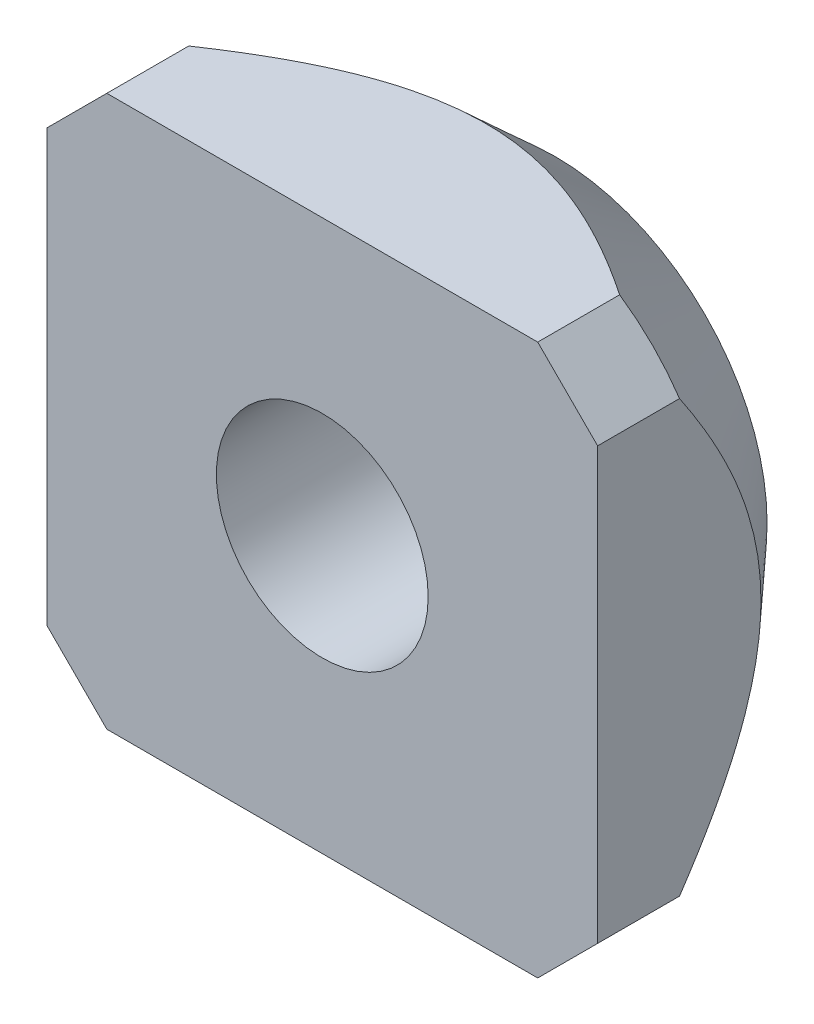
ISO-10303-21;
HEADER;
FILE_DESCRIPTION(('STEP AP214'),'2;1');
FILE_NAME('part.step','',(''),(''),'','','');
FILE_SCHEMA(('AUTOMOTIVE_DESIGN { 1 0 10303 214 1 1 1 1 }'));
ENDSEC;
DATA;
#1=APPLICATION_CONTEXT('core data for automotive mechanical design processes');
#2=APPLICATION_PROTOCOL_DEFINITION('international standard','automotive_design',2000,#1);
#3=PRODUCT_CONTEXT('',#1,'mechanical');
#4=PRODUCT('Part','Part','',(#3));
#5=PRODUCT_RELATED_PRODUCT_CATEGORY('part','',(#4));
#6=PRODUCT_DEFINITION_FORMATION('','',#4);
#7=PRODUCT_DEFINITION_CONTEXT('part definition',#1,'design');
#8=PRODUCT_DEFINITION('design','',#6,#7);
#9=PRODUCT_DEFINITION_SHAPE('','',#8);
#10=(LENGTH_UNIT() NAMED_UNIT(*) SI_UNIT(.MILLI.,.METRE.));
#11=(NAMED_UNIT(*) PLANE_ANGLE_UNIT() SI_UNIT($,.RADIAN.));
#12=(NAMED_UNIT(*) SI_UNIT($,.STERADIAN.) SOLID_ANGLE_UNIT());
#13=UNCERTAINTY_MEASURE_WITH_UNIT(LENGTH_MEASURE(1.E-05),#10,'distance_accuracy_value','');
#14=(GEOMETRIC_REPRESENTATION_CONTEXT(3) GLOBAL_UNCERTAINTY_ASSIGNED_CONTEXT((#13)) GLOBAL_UNIT_ASSIGNED_CONTEXT((#10,
#11,#12)) REPRESENTATION_CONTEXT('',''));
#15=CARTESIAN_POINT('',(0.,0.,0.));
#16=DIRECTION('',(0.,0.,1.));
#17=DIRECTION('',(1.,0.,0.));
#18=AXIS2_PLACEMENT_3D('',#15,#16,#17);
#19=CARTESIAN_POINT('',(0.,0.,-5.5));
#20=DIRECTION('',(0.,0.,1.));
#21=DIRECTION('',(1.,0.,0.));
#22=AXIS2_PLACEMENT_3D('',#19,#20,#21);
#23=PLANE('',#22);
#24=CARTESIAN_POINT('',(0.,0.,-5.5));
#25=DIRECTION('',(0.,0.,1.));
#26=DIRECTION('',(1.,0.,0.));
#27=AXIS2_PLACEMENT_3D('',#24,#25,#26);
#28=CIRCLE('',#27,2.5);
#29=CARTESIAN_POINT('',(2.5,0.,-5.5));
#30=VERTEX_POINT('',#29);
#31=EDGE_CURVE('E258',#30,#30,#28,.T.);
#32=ORIENTED_EDGE('',*,*,#31,.T.);
#33=EDGE_LOOP('',(#32));
#34=FACE_BOUND('',#33,.T.);
#35=CARTESIAN_POINT('',(0.,0.,-5.50000000287154));
#36=DIRECTION('',(0.,0.,1.));
#37=DIRECTION('',(1.,0.,0.));
#38=AXIS2_PLACEMENT_3D('',#35,#36,#37);
#39=CIRCLE('',#38,5.00000000314824);
#40=CARTESIAN_POINT('',(5.00000000314824,0.,-5.50000000287154));
#41=VERTEX_POINT('',#40);
#42=EDGE_CURVE('E37',#41,#41,#39,.T.);
#43=ORIENTED_EDGE('',*,*,#42,.F.);
#44=EDGE_LOOP('',(#43));
#45=FACE_BOUND('',#44,.T.);
#46=ADVANCED_FACE('F34',(#34,#45),#23,.F.);
#47=CARTESIAN_POINT('',(0.,0.,-1.91193420733516));
#48=DIRECTION('',(0.,0.,1.));
#49=DIRECTION('',(1.,0.,0.));
#50=AXIS2_PLACEMENT_3D('',#47,#48,#49);
#51=CONICAL_SURFACE('',#50,8.27271392518171,0.739466056088912);
#52=ORIENTED_EDGE('',*,*,#42,.T.);
#53=EDGE_LOOP('',(#52));
#54=FACE_BOUND('',#53,.T.);
#55=CARTESIAN_POINT('',(-6.49999999996656,5.08578643774263,-1.93333420218814));
#56=CARTESIAN_POINT('',(-6.49999999998799,4.97217656549041,-2.01007902749409));
#57=CARTESIAN_POINT('',(-6.49999999999678,4.85782950972393,-2.08574579284289));
#58=CARTESIAN_POINT('',(-6.50000000000322,4.62749756275461,-2.23459577320099));
#59=CARTESIAN_POINT('',(-6.50000000000086,4.51151233122406,-2.30777846107305));
#60=CARTESIAN_POINT('',(-6.49999999999913,4.27735001893202,-2.45156937006614));
#61=CARTESIAN_POINT('',(-6.49999999999976,4.15916634847437,-2.52216690472437));
#62=CARTESIAN_POINT('',(-6.50000000000024,3.92090179825337,-2.66006146574261));
#63=CARTESIAN_POINT('',(-6.50000000000008,3.80082102170299,-2.72735867084667));
#64=CARTESIAN_POINT('',(-6.49999999999983,3.43117049901182,-2.927024197621));
#65=CARTESIAN_POINT('',(-6.49999999999995,3.17828163281151,-3.05336340735418));
#66=CARTESIAN_POINT('',(-6.50000000000004,2.66320472724055,-3.2847897494762));
#67=CARTESIAN_POINT('',(-6.50000000000001,2.40103115726329,-3.38990837532806));
#68=CARTESIAN_POINT('',(-6.49999999999999,1.96194937878003,-3.54007016332442));
#69=CARTESIAN_POINT('',(-6.5,1.78780916432668,-3.5931930058844));
#70=CARTESIAN_POINT('',(-6.5,1.43593803357401,-3.68604206605222));
#71=CARTESIAN_POINT('',(-6.5,1.25820705951024,-3.72576806796325));
#72=CARTESIAN_POINT('',(-6.5,0.901971243864608,-3.78972854936986));
#73=CARTESIAN_POINT('',(-6.5,0.723496609813822,-3.81412921930872));
#74=CARTESIAN_POINT('',(-6.5,0.365074863040264,-3.84691624104865));
#75=CARTESIAN_POINT('',(-6.5,0.185127876429945,-3.85530395029257));
#76=CARTESIAN_POINT('',(-6.5,-0.175331996863656,-3.85561829853934));
#77=CARTESIAN_POINT('',(-6.5,-0.355844930170432,-3.84749448568778));
#78=CARTESIAN_POINT('',(-6.5,-0.715412000901114,-3.81512247996494));
#79=CARTESIAN_POINT('',(-6.5,-0.894466007670494,-3.79087285866508));
#80=CARTESIAN_POINT('',(-6.5,-1.25186987190293,-3.72710369302864));
#81=CARTESIAN_POINT('',(-6.5,-1.43018938883302,-3.6874161876482));
#82=CARTESIAN_POINT('',(-6.5,-1.7832209983363,-3.59454247061222));
#83=CARTESIAN_POINT('',(-6.5,-1.95793314761956,-3.54135647133646));
#84=CARTESIAN_POINT('',(-6.5,-2.39791270686289,-3.39110767153733));
#85=CARTESIAN_POINT('',(-6.5,-2.66041462883235,-3.2859613732665));
#86=CARTESIAN_POINT('',(-6.5,-3.17612601907367,-3.05441341529704));
#87=CARTESIAN_POINT('',(-6.5,-3.4293209389517,-2.92798006949308));
#88=CARTESIAN_POINT('',(-6.5,-3.79940591229883,-2.72814379751195));
#89=CARTESIAN_POINT('',(-6.5,-3.91962359960432,-2.66078705978884));
#90=CARTESIAN_POINT('',(-6.5,-4.15815744619399,-2.52276484072712));
#91=CARTESIAN_POINT('',(-6.5,-4.27647350172637,-2.45209917967338));
#92=CARTESIAN_POINT('',(-6.5,-4.510894297226,-2.30816632365151));
#93=CARTESIAN_POINT('',(-6.5,-4.62700566745187,-2.23490988206234));
#94=CARTESIAN_POINT('',(-6.5,-4.85758619181249,-2.08590677964123));
#95=CARTESIAN_POINT('',(-6.5,-4.97205568825616,-2.01016064904319));
#96=CARTESIAN_POINT('',(-6.5,-5.08578643774838,-1.93333420220499));
#97=B_SPLINE_CURVE_WITH_KNOTS('',3,(#55,#56,#57,#58,#59,#60,#61,#62,#63,#64,#65,#66,#67,#68,#69,
#70,#71,#72,#73,#74,#75,#76,#77,#78,#79,#80,#81,#82,#83,#84,#85,#86,#87,#88,#89,#90,#91,#92,#93,
#94,#95,#96),.UNSPECIFIED.,.F.,.F.,(4,2,2,2,2,2,2,2,2,2,2,2,2,2,2,2,2,2,2,2,4),(0.,
0.41131042679013,0.822707597462602,1.23564791332838,1.64856583981778,2.49590493844257,
3.34197710361053,3.88772071571207,4.43347311417834,4.97320018567055,5.51288150165221,
6.05421432221896,6.59559510058552,7.1430386002873,7.69047348727104,8.53748456918338,
9.38576777125056,9.79913116863559,10.2125170428237,10.6243522063669,11.0361002217524),.UNSPECIFIED.);
#98=CARTESIAN_POINT('',(-6.50000000001247,5.08578643767711,-1.93333420224238));
#99=VERTEX_POINT('',#98);
#100=CARTESIAN_POINT('',(-6.50000000001247,-5.08578643767711,-1.93333420224238));
#101=VERTEX_POINT('',#100);
#102=EDGE_CURVE('E168',#99,#101,#97,.T.);
#103=ORIENTED_EDGE('',*,*,#102,.F.);
#104=CARTESIAN_POINT('',(-5.08578643758324,6.50000000000418,-1.93333420227152));
#105=CARTESIAN_POINT('',(-5.20320338743552,6.38258305017716,-1.95544496406807));
#106=CARTESIAN_POINT('',(-5.32114245529566,6.26464398232743,-1.97213629505099));
#107=CARTESIAN_POINT('',(-5.55702028333326,6.02876615429746,-1.99438943436884));
#108=CARTESIAN_POINT('',(-5.6749567510727,5.9108296865553,-2.00000000038364));
#109=CARTESIAN_POINT('',(-5.91082968655301,5.67495675107281,-2.00000000038308));
#110=CARTESIAN_POINT('',(-6.02876615429389,5.55702028333248,-1.99438943436772));
#111=CARTESIAN_POINT('',(-6.2646439823281,5.32114245529936,-1.97213629505239));
#112=CARTESIAN_POINT('',(-6.38258305018337,5.20320338744464,-1.95544496407257));
#113=CARTESIAN_POINT('',(-6.50000000002287,5.08578643760404,-1.93333420228277));
#114=B_SPLINE_CURVE_WITH_KNOTS('',3,(#104,#105,#106,#107,#108,#109,#110,#111,#112,#113),
.UNSPECIFIED.,.F.,.F.,(4,2,2,2,4),(0.,0.502492195093159,1.00276834929097,1.50304450348823,
2.00553669858084),.UNSPECIFIED.);
#115=CARTESIAN_POINT('',(-5.08578643767711,6.50000000001248,-1.93333420224238));
#116=VERTEX_POINT('',#115);
#117=EDGE_CURVE('E175',#116,#99,#114,.T.);
#118=ORIENTED_EDGE('',*,*,#117,.F.);
#119=CARTESIAN_POINT('',(5.08578643774263,6.49999999996657,-1.93333420218813));
#120=CARTESIAN_POINT('',(4.9721765654904,6.49999999998799,-2.01007902749409));
#121=CARTESIAN_POINT('',(4.85782950972392,6.49999999999678,-2.08574579284289));
#122=CARTESIAN_POINT('',(4.62749756275461,6.50000000000322,-2.23459577320099));
#123=CARTESIAN_POINT('',(4.51151233122406,6.50000000000087,-2.30777846107305));
#124=CARTESIAN_POINT('',(4.27735001893202,6.49999999999913,-2.45156937006614));
#125=CARTESIAN_POINT('',(4.15916634847437,6.49999999999976,-2.52216690472436));
#126=CARTESIAN_POINT('',(3.92090179825336,6.50000000000024,-2.66006146574261));
#127=CARTESIAN_POINT('',(3.80082102170299,6.50000000000009,-2.72735867084667));
#128=CARTESIAN_POINT('',(3.43117049901181,6.49999999999983,-2.927024197621));
#129=CARTESIAN_POINT('',(3.17828163281151,6.49999999999996,-3.05336340735418));
#130=CARTESIAN_POINT('',(2.66320472724054,6.50000000000005,-3.2847897494762));
#131=CARTESIAN_POINT('',(2.40103115726328,6.50000000000001,-3.38990837532806));
#132=CARTESIAN_POINT('',(1.96194937878002,6.5,-3.54007016332442));
#133=CARTESIAN_POINT('',(1.78780916432667,6.5,-3.5931930058844));
#134=CARTESIAN_POINT('',(1.435938033574,6.50000000000001,-3.68604206605221));
#135=CARTESIAN_POINT('',(1.25820705951023,6.5,-3.72576806796325));
#136=CARTESIAN_POINT('',(0.901971243864601,6.5,-3.78972854936986));
#137=CARTESIAN_POINT('',(0.723496609813815,6.5,-3.81412921930872));
#138=CARTESIAN_POINT('',(0.365074863040257,6.5,-3.84691624104865));
#139=CARTESIAN_POINT('',(0.185127876429939,6.5,-3.85530395029256));
#140=CARTESIAN_POINT('',(-0.175331996863662,6.5,-3.85561829853934));
#141=CARTESIAN_POINT('',(-0.355844930170438,6.5,-3.84749448568778));
#142=CARTESIAN_POINT('',(-0.715412000901119,6.5,-3.81512247996494));
#143=CARTESIAN_POINT('',(-0.8944660076705,6.5,-3.79087285866508));
#144=CARTESIAN_POINT('',(-1.25186987190293,6.5,-3.72710369302863));
#145=CARTESIAN_POINT('',(-1.43018938883303,6.5,-3.68741618764819));
#146=CARTESIAN_POINT('',(-1.7832209983363,6.5,-3.59454247061221));
#147=CARTESIAN_POINT('',(-1.95793314761956,6.5,-3.54135647133646));
#148=CARTESIAN_POINT('',(-2.3979127068629,6.5,-3.39110767153733));
#149=CARTESIAN_POINT('',(-2.66041462883235,6.5,-3.2859613732665));
#150=CARTESIAN_POINT('',(-3.17612601907368,6.5,-3.05441341529704));
#151=CARTESIAN_POINT('',(-3.4293209389517,6.5,-2.92798006949307));
#152=CARTESIAN_POINT('',(-3.79940591229883,6.5,-2.72814379751195));
#153=CARTESIAN_POINT('',(-3.91962359960432,6.5,-2.66078705978884));
#154=CARTESIAN_POINT('',(-4.15815744619399,6.5,-2.52276484072712));
#155=CARTESIAN_POINT('',(-4.27647350172636,6.5,-2.45209917967338));
#156=CARTESIAN_POINT('',(-4.510894297226,6.5,-2.30816632365151));
#157=CARTESIAN_POINT('',(-4.62700566745187,6.5,-2.23490988206234));
#158=CARTESIAN_POINT('',(-4.85758619181248,6.5,-2.08590677964123));
#159=CARTESIAN_POINT('',(-4.97205568825616,6.5,-2.01016064904319));
#160=CARTESIAN_POINT('',(-5.08578643774838,6.5,-1.93333420220499));
#161=B_SPLINE_CURVE_WITH_KNOTS('',3,(#119,#120,#121,#122,#123,#124,#125,#126,#127,#128,#129,
#130,#131,#132,#133,#134,#135,#136,#137,#138,#139,#140,#141,#142,#143,#144,#145,#146,#147,#148,
#149,#150,#151,#152,#153,#154,#155,#156,#157,#158,#159,#160),.UNSPECIFIED.,.F.,.F.,(4,2,2,2,2,2,
2,2,2,2,2,2,2,2,2,2,2,2,2,2,4),(0.,0.411310426790131,0.822707597462601,1.23564791332838,
1.64856583981778,2.49590493844257,3.34197710361053,3.88772071571208,4.43347311417834,
4.97320018567055,5.51288150165221,6.05421432221896,6.59559510058552,7.1430386002873,
7.69047348727104,8.53748456918337,9.38576777125056,9.79913116863558,10.2125170428237,
10.6243522063669,11.0361002217524),.UNSPECIFIED.);
#162=CARTESIAN_POINT('',(5.08578643767711,6.50000000001247,-1.93333420224238));
#163=VERTEX_POINT('',#162);
#164=EDGE_CURVE('E103',#163,#116,#161,.T.);
#165=ORIENTED_EDGE('',*,*,#164,.F.);
#166=CARTESIAN_POINT('',(6.50000000000418,5.08578643758324,-1.93333420227152));
#167=CARTESIAN_POINT('',(6.38258305017715,5.20320338743553,-1.95544496406807));
#168=CARTESIAN_POINT('',(6.26464398232743,5.32114245529566,-1.97213629505098));
#169=CARTESIAN_POINT('',(6.02876615429745,5.55702028333326,-1.99438943436883));
#170=CARTESIAN_POINT('',(5.9108296865553,5.6749567510727,-2.00000000038364));
#171=CARTESIAN_POINT('',(5.67495675107281,5.91082968655302,-2.00000000038307));
#172=CARTESIAN_POINT('',(5.55702028333247,6.02876615429389,-1.99438943436771));
#173=CARTESIAN_POINT('',(5.32114245529936,6.2646439823281,-1.97213629505239));
#174=CARTESIAN_POINT('',(5.20320338744464,6.38258305018337,-1.95544496407257));
#175=CARTESIAN_POINT('',(5.08578643760404,6.50000000002287,-1.93333420228276));
#176=B_SPLINE_CURVE_WITH_KNOTS('',3,(#166,#167,#168,#169,#170,#171,#172,#173,#174,#175),
.UNSPECIFIED.,.F.,.F.,(4,2,2,2,4),(0.,0.502492195093158,1.00276834929097,1.50304450348823,
2.00553669858084),.UNSPECIFIED.);
#177=CARTESIAN_POINT('',(6.50000000001247,5.08578643761444,-1.93333420228472));
#178=VERTEX_POINT('',#177);
#179=EDGE_CURVE('E97',#178,#163,#176,.T.);
#180=ORIENTED_EDGE('',*,*,#179,.F.);
#181=CARTESIAN_POINT('',(6.49999999996656,-5.08578643774263,-1.93333420218813));
#182=CARTESIAN_POINT('',(6.49999999998799,-4.97217656549041,-2.01007902749409));
#183=CARTESIAN_POINT('',(6.49999999999678,-4.85782950972392,-2.08574579284288));
#184=CARTESIAN_POINT('',(6.50000000000322,-4.62749756275461,-2.23459577320098));
#185=CARTESIAN_POINT('',(6.50000000000087,-4.51151233122406,-2.30777846107305));
#186=CARTESIAN_POINT('',(6.49999999999913,-4.27735001893202,-2.45156937006614));
#187=CARTESIAN_POINT('',(6.49999999999976,-4.15916634847437,-2.52216690472436));
#188=CARTESIAN_POINT('',(6.50000000000024,-3.92090179825336,-2.6600614657426));
#189=CARTESIAN_POINT('',(6.50000000000008,-3.80082102170299,-2.72735867084666));
#190=CARTESIAN_POINT('',(6.49999999999983,-3.43117049901182,-2.927024197621));
#191=CARTESIAN_POINT('',(6.49999999999996,-3.17828163281151,-3.05336340735417));
#192=CARTESIAN_POINT('',(6.50000000000005,-2.66320472724054,-3.2847897494762));
#193=CARTESIAN_POINT('',(6.50000000000001,-2.40103115726328,-3.38990837532806));
#194=CARTESIAN_POINT('',(6.49999999999999,-1.96194937878003,-3.54007016332441));
#195=CARTESIAN_POINT('',(6.5,-1.78780916432667,-3.5931930058844));
#196=CARTESIAN_POINT('',(6.5,-1.435938033574,-3.68604206605221));
#197=CARTESIAN_POINT('',(6.5,-1.25820705951023,-3.72576806796324));
#198=CARTESIAN_POINT('',(6.5,-0.901971243864601,-3.78972854936985));
#199=CARTESIAN_POINT('',(6.5,-0.723496609813815,-3.81412921930872));
#200=CARTESIAN_POINT('',(6.5,-0.365074863040257,-3.84691624104865));
#201=CARTESIAN_POINT('',(6.5,-0.185127876429938,-3.85530395029256));
#202=CARTESIAN_POINT('',(6.5,0.175331996863663,-3.85561829853934));
#203=CARTESIAN_POINT('',(6.5,0.355844930170439,-3.84749448568778));
#204=CARTESIAN_POINT('',(6.5,0.715412000901121,-3.81512247996494));
#205=CARTESIAN_POINT('',(6.5,0.894466007670502,-3.79087285866508));
#206=CARTESIAN_POINT('',(6.5,1.25186987190294,-3.72710369302863));
#207=CARTESIAN_POINT('',(6.5,1.43018938883303,-3.68741618764819));
#208=CARTESIAN_POINT('',(6.5,1.7832209983363,-3.59454247061221));
#209=CARTESIAN_POINT('',(6.5,1.95793314761957,-3.54135647133646));
#210=CARTESIAN_POINT('',(6.5,2.3979127068629,-3.39110767153733));
#211=CARTESIAN_POINT('',(6.5,2.66041462883236,-3.2859613732665));
#212=CARTESIAN_POINT('',(6.5,3.17612601907368,-3.05441341529703));
#213=CARTESIAN_POINT('',(6.5,3.42932093895171,-2.92798006949307));
#214=CARTESIAN_POINT('',(6.5,3.79940591229883,-2.72814379751194));
#215=CARTESIAN_POINT('',(6.5,3.91962359960432,-2.66078705978883));
#216=CARTESIAN_POINT('',(6.5,4.15815744619399,-2.52276484072711));
#217=CARTESIAN_POINT('',(6.5,4.27647350172637,-2.45209917967337));
#218=CARTESIAN_POINT('',(6.5,4.51089429722601,-2.30816632365151));
#219=CARTESIAN_POINT('',(6.5,4.62700566745188,-2.23490988206234));
#220=CARTESIAN_POINT('',(6.5,4.85758619181249,-2.08590677964122));
#221=CARTESIAN_POINT('',(6.5,4.97205568825616,-2.01016064904319));
#222=CARTESIAN_POINT('',(6.5,5.08578643774839,-1.93333420220499));
#223=B_SPLINE_CURVE_WITH_KNOTS('',3,(#181,#182,#183,#184,#185,#186,#187,#188,#189,#190,#191,
#192,#193,#194,#195,#196,#197,#198,#199,#200,#201,#202,#203,#204,#205,#206,#207,#208,#209,#210,
#211,#212,#213,#214,#215,#216,#217,#218,#219,#220,#221,#222),.UNSPECIFIED.,.F.,.F.,(4,2,2,2,2,2,
2,2,2,2,2,2,2,2,2,2,2,2,2,2,4),(0.,0.411310426790131,0.822707597462602,1.23564791332838,
1.64856583981778,2.49590493844257,3.34197710361053,3.88772071571208,4.43347311417835,
4.97320018567056,5.51288150165222,6.05421432221896,6.59559510058553,7.14303860028731,
7.69047348727105,8.53748456918338,9.38576777125057,9.79913116863559,10.2125170428237,
10.6243522063669,11.0361002217524),.UNSPECIFIED.);
#224=CARTESIAN_POINT('',(6.50000000001247,-5.08578643767711,-1.93333420224237));
#225=VERTEX_POINT('',#224);
#226=EDGE_CURVE('E101',#225,#178,#223,.T.);
#227=ORIENTED_EDGE('',*,*,#226,.F.);
#228=CARTESIAN_POINT('',(5.08578643758324,-6.50000000000418,-1.93333420227152));
#229=CARTESIAN_POINT('',(5.20320338743552,-6.38258305017716,-1.95544496406807));
#230=CARTESIAN_POINT('',(5.32114245529566,-6.26464398232743,-1.97213629505098));
#231=CARTESIAN_POINT('',(5.55702028333326,-6.02876615429746,-1.99438943436883));
#232=CARTESIAN_POINT('',(5.6749567510727,-5.9108296865553,-2.00000000038364));
#233=CARTESIAN_POINT('',(5.91082968655301,-5.67495675107281,-2.00000000038307));
#234=CARTESIAN_POINT('',(6.02876615429389,-5.55702028333248,-1.99438943436771));
#235=CARTESIAN_POINT('',(6.2646439823281,-5.32114245529936,-1.97213629505238));
#236=CARTESIAN_POINT('',(6.38258305018337,-5.20320338744464,-1.95544496407256));
#237=CARTESIAN_POINT('',(6.50000000002286,-5.08578643760405,-1.93333420228276));
#238=B_SPLINE_CURVE_WITH_KNOTS('',3,(#228,#229,#230,#231,#232,#233,#234,#235,#236,#237),
.UNSPECIFIED.,.F.,.F.,(4,2,2,2,4),(0.,0.502492195093158,1.00276834929097,1.50304450348823,
2.00553669858084),.UNSPECIFIED.);
#239=CARTESIAN_POINT('',(5.08578643767711,-6.50000000001247,-1.93333420224237));
#240=VERTEX_POINT('',#239);
#241=EDGE_CURVE('E117',#240,#225,#238,.T.);
#242=ORIENTED_EDGE('',*,*,#241,.F.);
#243=CARTESIAN_POINT('',(-5.08578643774262,-6.49999999996657,-1.93333420218813));
#244=CARTESIAN_POINT('',(-4.9721765654904,-6.49999999998799,-2.01007902749409));
#245=CARTESIAN_POINT('',(-4.85782950972392,-6.49999999999678,-2.08574579284288));
#246=CARTESIAN_POINT('',(-4.62749756275461,-6.50000000000322,-2.23459577320099));
#247=CARTESIAN_POINT('',(-4.51151233122405,-6.50000000000087,-2.30777846107305));
#248=CARTESIAN_POINT('',(-4.27735001893202,-6.49999999999913,-2.45156937006614));
#249=CARTESIAN_POINT('',(-4.15916634847437,-6.49999999999976,-2.52216690472436));
#250=CARTESIAN_POINT('',(-3.92090179825336,-6.50000000000024,-2.6600614657426));
#251=CARTESIAN_POINT('',(-3.80082102170298,-6.50000000000009,-2.72735867084667));
#252=CARTESIAN_POINT('',(-3.43117049901181,-6.49999999999983,-2.927024197621));
#253=CARTESIAN_POINT('',(-3.1782816328115,-6.49999999999996,-3.05336340735418));
#254=CARTESIAN_POINT('',(-2.66320472724054,-6.50000000000005,-3.2847897494762));
#255=CARTESIAN_POINT('',(-2.40103115726328,-6.50000000000001,-3.38990837532806));
#256=CARTESIAN_POINT('',(-1.96194937878002,-6.5,-3.54007016332441));
#257=CARTESIAN_POINT('',(-1.78780916432667,-6.5,-3.5931930058844));
#258=CARTESIAN_POINT('',(-1.435938033574,-6.5,-3.68604206605221));
#259=CARTESIAN_POINT('',(-1.25820705951023,-6.5,-3.72576806796324));
#260=CARTESIAN_POINT('',(-0.9019712438646,-6.5,-3.78972854936985));
#261=CARTESIAN_POINT('',(-0.723496609813814,-6.5,-3.81412921930872));
#262=CARTESIAN_POINT('',(-0.365074863040256,-6.5,-3.84691624104865));
#263=CARTESIAN_POINT('',(-0.185127876429937,-6.5,-3.85530395029256));
#264=CARTESIAN_POINT('',(0.175331996863664,-6.5,-3.85561829853933));
#265=CARTESIAN_POINT('',(0.35584493017044,-6.5,-3.84749448568777));
#266=CARTESIAN_POINT('',(0.715412000901122,-6.5,-3.81512247996493));
#267=CARTESIAN_POINT('',(0.894466007670503,-6.5,-3.79087285866508));
#268=CARTESIAN_POINT('',(1.25186987190294,-6.5,-3.72710369302863));
#269=CARTESIAN_POINT('',(1.43018938883303,-6.5,-3.68741618764819));
#270=CARTESIAN_POINT('',(1.7832209983363,-6.5,-3.59454247061221));
#271=CARTESIAN_POINT('',(1.95793314761957,-6.5,-3.54135647133645));
#272=CARTESIAN_POINT('',(2.3979127068629,-6.5,-3.39110767153732));
#273=CARTESIAN_POINT('',(2.66041462883236,-6.5,-3.28596137326649));
#274=CARTESIAN_POINT('',(3.17612601907368,-6.5,-3.05441341529703));
#275=CARTESIAN_POINT('',(3.42932093895171,-6.5,-2.92798006949307));
#276=CARTESIAN_POINT('',(3.79940591229883,-6.5,-2.72814379751194));
#277=CARTESIAN_POINT('',(3.91962359960432,-6.5,-2.66078705978883));
#278=CARTESIAN_POINT('',(4.15815744619399,-6.5,-2.52276484072711));
#279=CARTESIAN_POINT('',(4.27647350172637,-6.5,-2.45209917967337));
#280=CARTESIAN_POINT('',(4.510894297226,-6.5,-2.30816632365151));
#281=CARTESIAN_POINT('',(4.62700566745187,-6.5,-2.23490988206233));
#282=CARTESIAN_POINT('',(4.85758619181248,-6.5,-2.08590677964122));
#283=CARTESIAN_POINT('',(4.97205568825616,-6.5,-2.01016064904318));
#284=CARTESIAN_POINT('',(5.08578643774838,-6.5,-1.93333420220499));
#285=B_SPLINE_CURVE_WITH_KNOTS('',3,(#243,#244,#245,#246,#247,#248,#249,#250,#251,#252,#253,
#254,#255,#256,#257,#258,#259,#260,#261,#262,#263,#264,#265,#266,#267,#268,#269,#270,#271,#272,
#273,#274,#275,#276,#277,#278,#279,#280,#281,#282,#283,#284),.UNSPECIFIED.,.F.,.F.,(4,2,2,2,2,2,
2,2,2,2,2,2,2,2,2,2,2,2,2,2,4),(0.,0.411310426790131,0.822707597462601,1.23564791332838,
1.64856583981778,2.49590493844257,3.34197710361053,3.88772071571207,4.43347311417834,
4.97320018567055,5.51288150165221,6.05421432221896,6.59559510058552,7.1430386002873,
7.69047348727104,8.53748456918338,9.38576777125056,9.79913116863558,10.2125170428237,
10.6243522063669,11.0361002217524),.UNSPECIFIED.);
#286=CARTESIAN_POINT('',(-5.08578643767711,-6.50000000001247,-1.93333420224237));
#287=VERTEX_POINT('',#286);
#288=EDGE_CURVE('E153',#287,#240,#285,.T.);
#289=ORIENTED_EDGE('',*,*,#288,.F.);
#290=CARTESIAN_POINT('',(-6.50000000000418,-5.08578643758324,-1.93333420227152));
#291=CARTESIAN_POINT('',(-6.38258305017715,-5.20320338743553,-1.95544496406807));
#292=CARTESIAN_POINT('',(-6.26464398232743,-5.32114245529566,-1.97213629505099));
#293=CARTESIAN_POINT('',(-6.02876615429745,-5.55702028333326,-1.99438943436883));
#294=CARTESIAN_POINT('',(-5.9108296865553,-5.6749567510727,-2.00000000038364));
#295=CARTESIAN_POINT('',(-5.6749567510728,-5.91082968655301,-2.00000000038307));
#296=CARTESIAN_POINT('',(-5.55702028333247,-6.02876615429389,-1.99438943436771));
#297=CARTESIAN_POINT('',(-5.32114245529935,-6.2646439823281,-1.97213629505239));
#298=CARTESIAN_POINT('',(-5.20320338744463,-6.38258305018337,-1.95544496407257));
#299=CARTESIAN_POINT('',(-5.08578643760404,-6.50000000002287,-1.93333420228276));
#300=B_SPLINE_CURVE_WITH_KNOTS('',3,(#290,#291,#292,#293,#294,#295,#296,#297,#298,#299),
.UNSPECIFIED.,.F.,.F.,(4,2,2,2,4),(0.,0.50249219509316,1.00276834929097,1.50304450348824,
2.00553669858085),.UNSPECIFIED.);
#301=EDGE_CURVE('E161',#101,#287,#300,.T.);
#302=ORIENTED_EDGE('',*,*,#301,.F.);
#303=EDGE_LOOP('',(#103,#118,#165,#180,#227,#242,#289,#302));
#304=FACE_BOUND('',#303,.T.);
#305=ADVANCED_FACE('F99',(#54,#304),#51,.T.);
#306=CARTESIAN_POINT('',(6.5,5.08578643762691,0.));
#307=DIRECTION('',(0.707106781186548,0.707106781186548,0.));
#308=DIRECTION('',(-0.707106781186548,0.707106781186548,0.));
#309=AXIS2_PLACEMENT_3D('',#306,#307,#308);
#310=PLANE('',#309);
#311=DIRECTION('',(-0.707106781186547,0.707106781186547,0.));
#312=VECTOR('',#311,1.);
#313=CARTESIAN_POINT('',(6.5,5.08578643762691,0.));
#314=LINE('',#313,#312);
#315=CARTESIAN_POINT('',(6.5,5.08578643762691,0.));
#316=VERTEX_POINT('',#315);
#317=CARTESIAN_POINT('',(5.08578643762691,6.5,0.));
#318=VERTEX_POINT('',#317);
#319=EDGE_CURVE('E110',#316,#318,#314,.T.);
#320=ORIENTED_EDGE('',*,*,#319,.F.);
#321=DIRECTION('',(0.,0.,-1.));
#322=VECTOR('',#321,1.);
#323=CARTESIAN_POINT('',(6.5,5.08578643762691,0.));
#324=LINE('',#323,#322);
#325=EDGE_CURVE('E107',#178,#316,#324,.F.);
#326=ORIENTED_EDGE('',*,*,#325,.F.);
#327=ORIENTED_EDGE('',*,*,#179,.T.);
#328=DIRECTION('',(0.,0.,1.));
#329=VECTOR('',#328,1.);
#330=CARTESIAN_POINT('',(5.08578643762691,6.5,0.));
#331=LINE('',#330,#329);
#332=EDGE_CURVE('E183',#318,#163,#331,.F.);
#333=ORIENTED_EDGE('',*,*,#332,.F.);
#334=EDGE_LOOP('',(#320,#326,#327,#333));
#335=FACE_BOUND('',#334,.T.);
#336=ADVANCED_FACE('F108',(#335),#310,.T.);
#337=CARTESIAN_POINT('',(5.08578643762691,6.5,0.));
#338=DIRECTION('',(0.,1.,0.));
#339=DIRECTION('',(0.,0.,1.));
#340=AXIS2_PLACEMENT_3D('',#337,#338,#339);
#341=PLANE('',#340);
#342=DIRECTION('',(1.,0.,0.));
#343=VECTOR('',#342,1.);
#344=CARTESIAN_POINT('',(0.,6.5,0.));
#345=LINE('',#344,#343);
#346=CARTESIAN_POINT('',(-5.0857864376269,6.50000000000001,0.));
#347=VERTEX_POINT('',#346);
#348=EDGE_CURVE('E126',#318,#347,#345,.F.);
#349=ORIENTED_EDGE('',*,*,#348,.F.);
#350=ORIENTED_EDGE('',*,*,#332,.T.);
#351=ORIENTED_EDGE('',*,*,#164,.T.);
#352=DIRECTION('',(0.,0.,1.));
#353=VECTOR('',#352,1.);
#354=CARTESIAN_POINT('',(-5.0857864376269,6.50000000000001,0.));
#355=LINE('',#354,#353);
#356=EDGE_CURVE('E182',#347,#116,#355,.F.);
#357=ORIENTED_EDGE('',*,*,#356,.F.);
#358=EDGE_LOOP('',(#349,#350,#351,#357));
#359=FACE_BOUND('',#358,.T.);
#360=ADVANCED_FACE('F192',(#359),#341,.T.);
#361=CARTESIAN_POINT('',(-5.0857864376269,6.50000000000001,0.));
#362=DIRECTION('',(-0.707106781186548,0.707106781186548,0.));
#363=DIRECTION('',(-0.707106781186548,-0.707106781186548,0.));
#364=AXIS2_PLACEMENT_3D('',#361,#362,#363);
#365=PLANE('',#364);
#366=DIRECTION('',(-0.707106781186547,-0.707106781186547,0.));
#367=VECTOR('',#366,1.);
#368=CARTESIAN_POINT('',(-5.0857864376269,6.50000000000001,0.));
#369=LINE('',#368,#367);
#370=CARTESIAN_POINT('',(-6.5,5.08578643762691,0.));
#371=VERTEX_POINT('',#370);
#372=EDGE_CURVE('E231',#347,#371,#369,.T.);
#373=ORIENTED_EDGE('',*,*,#372,.F.);
#374=ORIENTED_EDGE('',*,*,#356,.T.);
#375=ORIENTED_EDGE('',*,*,#117,.T.);
#376=DIRECTION('',(0.,0.,1.));
#377=VECTOR('',#376,1.);
#378=CARTESIAN_POINT('',(-6.5,5.08578643762691,0.));
#379=LINE('',#378,#377);
#380=EDGE_CURVE('E238',#371,#99,#379,.F.);
#381=ORIENTED_EDGE('',*,*,#380,.F.);
#382=EDGE_LOOP('',(#373,#374,#375,#381));
#383=FACE_BOUND('',#382,.T.);
#384=ADVANCED_FACE('F188',(#383),#365,.T.);
#385=CARTESIAN_POINT('',(-6.5,5.08578643762691,0.));
#386=DIRECTION('',(-1.,0.,0.));
#387=DIRECTION('',(0.,0.,1.));
#388=AXIS2_PLACEMENT_3D('',#385,#386,#387);
#389=PLANE('',#388);
#390=DIRECTION('',(0.,1.,0.));
#391=VECTOR('',#390,1.);
#392=CARTESIAN_POINT('',(-6.5,0.,0.));
#393=LINE('',#392,#391);
#394=CARTESIAN_POINT('',(-6.5,-5.08578643762691,0.));
#395=VERTEX_POINT('',#394);
#396=EDGE_CURVE('E229',#371,#395,#393,.F.);
#397=ORIENTED_EDGE('',*,*,#396,.F.);
#398=ORIENTED_EDGE('',*,*,#380,.T.);
#399=ORIENTED_EDGE('',*,*,#102,.T.);
#400=DIRECTION('',(0.,0.,1.));
#401=VECTOR('',#400,1.);
#402=CARTESIAN_POINT('',(-6.5,-5.08578643762691,0.));
#403=LINE('',#402,#401);
#404=EDGE_CURVE('E244',#395,#101,#403,.F.);
#405=ORIENTED_EDGE('',*,*,#404,.F.);
#406=EDGE_LOOP('',(#397,#398,#399,#405));
#407=FACE_BOUND('',#406,.T.);
#408=ADVANCED_FACE('F191',(#407),#389,.T.);
#409=CARTESIAN_POINT('',(-6.5,-5.08578643762691,0.));
#410=DIRECTION('',(-0.707106781186548,-0.707106781186548,0.));
#411=DIRECTION('',(0.707106781186548,-0.707106781186548,0.));
#412=AXIS2_PLACEMENT_3D('',#409,#410,#411);
#413=PLANE('',#412);
#414=DIRECTION('',(0.707106781186547,-0.707106781186548,0.));
#415=VECTOR('',#414,1.);
#416=CARTESIAN_POINT('',(-6.5,-5.08578643762691,0.));
#417=LINE('',#416,#415);
#418=CARTESIAN_POINT('',(-5.08578643762691,-6.5,0.));
#419=VERTEX_POINT('',#418);
#420=EDGE_CURVE('E223',#395,#419,#417,.T.);
#421=ORIENTED_EDGE('',*,*,#420,.F.);
#422=ORIENTED_EDGE('',*,*,#404,.T.);
#423=ORIENTED_EDGE('',*,*,#301,.T.);
#424=DIRECTION('',(0.,0.,-1.));
#425=VECTOR('',#424,1.);
#426=CARTESIAN_POINT('',(-5.08578643762691,-6.5,0.));
#427=LINE('',#426,#425);
#428=EDGE_CURVE('E250',#419,#287,#427,.T.);
#429=ORIENTED_EDGE('',*,*,#428,.F.);
#430=EDGE_LOOP('',(#421,#422,#423,#429));
#431=FACE_BOUND('',#430,.T.);
#432=ADVANCED_FACE('F247',(#431),#413,.T.);
#433=CARTESIAN_POINT('',(-5.08578643762691,-6.5,0.));
#434=DIRECTION('',(0.,-1.,0.));
#435=DIRECTION('',(0.,0.,-1.));
#436=AXIS2_PLACEMENT_3D('',#433,#434,#435);
#437=PLANE('',#436);
#438=DIRECTION('',(1.,0.,0.));
#439=VECTOR('',#438,1.);
#440=CARTESIAN_POINT('',(0.,-6.5,0.));
#441=LINE('',#440,#439);
#442=CARTESIAN_POINT('',(5.08578643762691,-6.5,0.));
#443=VERTEX_POINT('',#442);
#444=EDGE_CURVE('E221',#419,#443,#441,.T.);
#445=ORIENTED_EDGE('',*,*,#444,.F.);
#446=ORIENTED_EDGE('',*,*,#428,.T.);
#447=ORIENTED_EDGE('',*,*,#288,.T.);
#448=DIRECTION('',(0.,0.,1.));
#449=VECTOR('',#448,1.);
#450=CARTESIAN_POINT('',(5.08578643762691,-6.5,0.));
#451=LINE('',#450,#449);
#452=EDGE_CURVE('E114',#443,#240,#451,.F.);
#453=ORIENTED_EDGE('',*,*,#452,.F.);
#454=EDGE_LOOP('',(#445,#446,#447,#453));
#455=FACE_BOUND('',#454,.T.);
#456=ADVANCED_FACE('F254',(#455),#437,.T.);
#457=CARTESIAN_POINT('',(5.08578643762691,-6.5,0.));
#458=DIRECTION('',(0.707106781186548,-0.707106781186548,0.));
#459=DIRECTION('',(0.707106781186548,0.707106781186548,0.));
#460=AXIS2_PLACEMENT_3D('',#457,#458,#459);
#461=PLANE('',#460);
#462=DIRECTION('',(0.707106781186547,0.707106781186548,0.));
#463=VECTOR('',#462,1.);
#464=CARTESIAN_POINT('',(5.08578643762691,-6.5,0.));
#465=LINE('',#464,#463);
#466=CARTESIAN_POINT('',(6.5,-5.08578643762691,0.));
#467=VERTEX_POINT('',#466);
#468=EDGE_CURVE('E43',#443,#467,#465,.T.);
#469=ORIENTED_EDGE('',*,*,#468,.F.);
#470=ORIENTED_EDGE('',*,*,#452,.T.);
#471=ORIENTED_EDGE('',*,*,#241,.T.);
#472=DIRECTION('',(0.,0.,-1.));
#473=VECTOR('',#472,1.);
#474=CARTESIAN_POINT('',(6.5,-5.08578643762691,0.));
#475=LINE('',#474,#473);
#476=EDGE_CURVE('E52',#467,#225,#475,.T.);
#477=ORIENTED_EDGE('',*,*,#476,.F.);
#478=EDGE_LOOP('',(#469,#470,#471,#477));
#479=FACE_BOUND('',#478,.T.);
#480=ADVANCED_FACE('F212',(#479),#461,.T.);
#481=CARTESIAN_POINT('',(6.5,-5.08578643762691,0.));
#482=DIRECTION('',(1.,0.,0.));
#483=DIRECTION('',(0.,0.,-1.));
#484=AXIS2_PLACEMENT_3D('',#481,#482,#483);
#485=PLANE('',#484);
#486=DIRECTION('',(0.,1.,0.));
#487=VECTOR('',#486,1.);
#488=CARTESIAN_POINT('',(6.5,0.,0.));
#489=LINE('',#488,#487);
#490=EDGE_CURVE('E11',#467,#316,#489,.T.);
#491=ORIENTED_EDGE('',*,*,#490,.F.);
#492=ORIENTED_EDGE('',*,*,#476,.T.);
#493=ORIENTED_EDGE('',*,*,#226,.T.);
#494=ORIENTED_EDGE('',*,*,#325,.T.);
#495=EDGE_LOOP('',(#491,#492,#493,#494));
#496=FACE_BOUND('',#495,.T.);
#497=ADVANCED_FACE('F113',(#496),#485,.T.);
#498=CARTESIAN_POINT('',(0.,0.,0.));
#499=DIRECTION('',(0.,0.,1.));
#500=DIRECTION('',(1.,0.,0.));
#501=AXIS2_PLACEMENT_3D('',#498,#499,#500);
#502=PLANE('',#501);
#503=CARTESIAN_POINT('',(0.,0.,0.));
#504=DIRECTION('',(0.,0.,1.));
#505=DIRECTION('',(1.,0.,0.));
#506=AXIS2_PLACEMENT_3D('',#503,#504,#505);
#507=CIRCLE('',#506,2.5);
#508=CARTESIAN_POINT('',(2.5,0.,0.));
#509=VERTEX_POINT('',#508);
#510=EDGE_CURVE('E216',#509,#509,#507,.T.);
#511=ORIENTED_EDGE('',*,*,#510,.F.);
#512=EDGE_LOOP('',(#511));
#513=FACE_BOUND('',#512,.T.);
#514=ORIENTED_EDGE('',*,*,#468,.T.);
#515=ORIENTED_EDGE('',*,*,#490,.T.);
#516=ORIENTED_EDGE('',*,*,#319,.T.);
#517=ORIENTED_EDGE('',*,*,#348,.T.);
#518=ORIENTED_EDGE('',*,*,#372,.T.);
#519=ORIENTED_EDGE('',*,*,#396,.T.);
#520=ORIENTED_EDGE('',*,*,#420,.T.);
#521=ORIENTED_EDGE('',*,*,#444,.T.);
#522=EDGE_LOOP('',(#514,#515,#516,#517,#518,#519,#520,#521));
#523=FACE_BOUND('',#522,.T.);
#524=ADVANCED_FACE('F202',(#513,#523),#502,.T.);
#525=CARTESIAN_POINT('',(0.,0.,0.));
#526=DIRECTION('',(0.,0.,1.));
#527=DIRECTION('',(1.,0.,0.));
#528=AXIS2_PLACEMENT_3D('',#525,#526,#527);
#529=CYLINDRICAL_SURFACE('',#528,2.5);
#530=ORIENTED_EDGE('',*,*,#510,.T.);
#531=EDGE_LOOP('',(#530));
#532=FACE_BOUND('',#531,.T.);
#533=ORIENTED_EDGE('',*,*,#31,.F.);
#534=EDGE_LOOP('',(#533));
#535=FACE_BOUND('',#534,.T.);
#536=ADVANCED_FACE('F204',(#532,#535),#529,.F.);
#537=CLOSED_SHELL('',(#46,#305,#336,#360,#384,#408,#432,#456,#480,#497,#524,#536));
#538=MANIFOLD_SOLID_BREP('B2',#537);
#539=ADVANCED_BREP_SHAPE_REPRESENTATION('',(#18,#538),#14);
#540=SHAPE_DEFINITION_REPRESENTATION(#9,#539);
ENDSEC;
END-ISO-10303-21;
